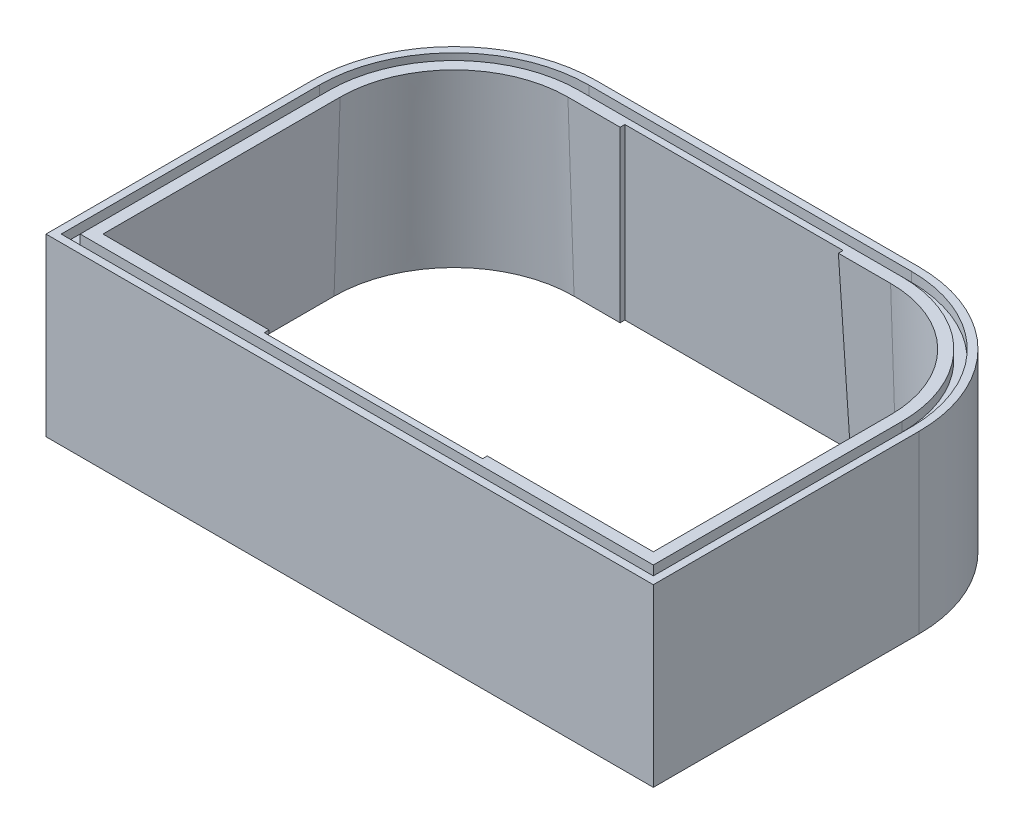
ISO-10303-21;
HEADER;
FILE_DESCRIPTION(('STEP AP214'),'2;1');
FILE_NAME('part.step','',(''),(''),'','','');
FILE_SCHEMA(('AUTOMOTIVE_DESIGN { 1 0 10303 214 1 1 1 1 }'));
ENDSEC;
DATA;
#1=APPLICATION_CONTEXT('core data for automotive mechanical design processes');
#2=APPLICATION_PROTOCOL_DEFINITION('international standard','automotive_design',2000,#1);
#3=PRODUCT_CONTEXT('',#1,'mechanical');
#4=PRODUCT('Part','Part','',(#3));
#5=PRODUCT_RELATED_PRODUCT_CATEGORY('part','',(#4));
#6=PRODUCT_DEFINITION_FORMATION('','',#4);
#7=PRODUCT_DEFINITION_CONTEXT('part definition',#1,'design');
#8=PRODUCT_DEFINITION('design','',#6,#7);
#9=PRODUCT_DEFINITION_SHAPE('','',#8);
#10=(LENGTH_UNIT() NAMED_UNIT(*) SI_UNIT(.MILLI.,.METRE.));
#11=(NAMED_UNIT(*) PLANE_ANGLE_UNIT() SI_UNIT($,.RADIAN.));
#12=(NAMED_UNIT(*) SI_UNIT($,.STERADIAN.) SOLID_ANGLE_UNIT());
#13=UNCERTAINTY_MEASURE_WITH_UNIT(LENGTH_MEASURE(1.E-05),#10,'distance_accuracy_value','');
#14=(GEOMETRIC_REPRESENTATION_CONTEXT(3) GLOBAL_UNCERTAINTY_ASSIGNED_CONTEXT((#13)) GLOBAL_UNIT_ASSIGNED_CONTEXT((#10,
#11,#12)) REPRESENTATION_CONTEXT('',''));
#15=CARTESIAN_POINT('',(0.,0.,0.));
#16=DIRECTION('',(0.,0.,1.));
#17=DIRECTION('',(1.,0.,0.));
#18=AXIS2_PLACEMENT_3D('',#15,#16,#17);
#19=CARTESIAN_POINT('',(0.,185.,0.));
#20=DIRECTION('',(0.,-1.,0.));
#21=DIRECTION('',(0.,0.,-1.));
#22=AXIS2_PLACEMENT_3D('',#19,#20,#21);
#23=PLANE('',#22);
#24=DIRECTION('',(-1.,0.,0.));
#25=VECTOR('',#24,1.);
#26=CARTESIAN_POINT('',(205.,185.,-400.));
#27=LINE('',#26,#25);
#28=CARTESIAN_POINT('',(205.,185.,-400.));
#29=VERTEX_POINT('',#28);
#30=CARTESIAN_POINT('',(150.,185.,-400.));
#31=VERTEX_POINT('',#30);
#32=EDGE_CURVE('E385',#29,#31,#27,.T.);
#33=ORIENTED_EDGE('',*,*,#32,.F.);
#34=DIRECTION('',(0.,0.,1.));
#35=VECTOR('',#34,1.);
#36=CARTESIAN_POINT('',(205.,185.,-400.));
#37=LINE('',#36,#35);
#38=CARTESIAN_POINT('',(205.,185.,-405.));
#39=VERTEX_POINT('',#38);
#40=EDGE_CURVE('E374',#39,#29,#37,.T.);
#41=ORIENTED_EDGE('',*,*,#40,.F.);
#42=DIRECTION('',(-1.,0.,0.));
#43=VECTOR('',#42,1.);
#44=CARTESIAN_POINT('',(205.,185.,-405.));
#45=LINE('',#44,#43);
#46=CARTESIAN_POINT('',(435.,185.,-405.));
#47=VERTEX_POINT('',#46);
#48=EDGE_CURVE('E421',#47,#39,#45,.T.);
#49=ORIENTED_EDGE('',*,*,#48,.F.);
#50=DIRECTION('',(0.,0.,-1.));
#51=VECTOR('',#50,1.);
#52=CARTESIAN_POINT('',(435.,185.,-400.));
#53=LINE('',#52,#51);
#54=CARTESIAN_POINT('',(435.,185.,-400.));
#55=VERTEX_POINT('',#54);
#56=EDGE_CURVE('E418',#55,#47,#53,.T.);
#57=ORIENTED_EDGE('',*,*,#56,.F.);
#58=DIRECTION('',(-1.,0.,0.));
#59=VECTOR('',#58,1.);
#60=CARTESIAN_POINT('',(490.,185.,-400.));
#61=LINE('',#60,#59);
#62=CARTESIAN_POINT('',(490.,185.,-400.));
#63=VERTEX_POINT('',#62);
#64=EDGE_CURVE('E415',#63,#55,#61,.T.);
#65=ORIENTED_EDGE('',*,*,#64,.F.);
#66=CARTESIAN_POINT('',(490.,185.,-280.));
#67=DIRECTION('',(0.,1.,0.));
#68=DIRECTION('',(0.,0.,1.));
#69=AXIS2_PLACEMENT_3D('',#66,#67,#68);
#70=CIRCLE('',#69,120.);
#71=CARTESIAN_POINT('',(610.,185.,-280.));
#72=VERTEX_POINT('',#71);
#73=EDGE_CURVE('E412',#72,#63,#70,.T.);
#74=ORIENTED_EDGE('',*,*,#73,.F.);
#75=DIRECTION('',(0.,0.,-1.));
#76=VECTOR('',#75,1.);
#77=CARTESIAN_POINT('',(610.,185.,-30.));
#78=LINE('',#77,#76);
#79=CARTESIAN_POINT('',(610.,185.,-30.));
#80=VERTEX_POINT('',#79);
#81=EDGE_CURVE('E409',#80,#72,#78,.T.);
#82=ORIENTED_EDGE('',*,*,#81,.F.);
#83=DIRECTION('',(1.,0.,0.));
#84=VECTOR('',#83,1.);
#85=CARTESIAN_POINT('',(435.,185.,-30.0000000000001));
#86=LINE('',#85,#84);
#87=CARTESIAN_POINT('',(435.,185.,-30.0000000000001));
#88=VERTEX_POINT('',#87);
#89=EDGE_CURVE('E406',#88,#80,#86,.T.);
#90=ORIENTED_EDGE('',*,*,#89,.F.);
#91=DIRECTION('',(0.,0.,-1.));
#92=VECTOR('',#91,1.);
#93=CARTESIAN_POINT('',(435.,185.,-30.0000000000001));
#94=LINE('',#93,#92);
#95=CARTESIAN_POINT('',(435.,185.,-25.));
#96=VERTEX_POINT('',#95);
#97=EDGE_CURVE('E403',#96,#88,#94,.T.);
#98=ORIENTED_EDGE('',*,*,#97,.F.);
#99=DIRECTION('',(1.,0.,0.));
#100=VECTOR('',#99,1.);
#101=CARTESIAN_POINT('',(435.,185.,-25.));
#102=LINE('',#101,#100);
#103=CARTESIAN_POINT('',(205.,185.,-25.));
#104=VERTEX_POINT('',#103);
#105=EDGE_CURVE('E400',#104,#96,#102,.T.);
#106=ORIENTED_EDGE('',*,*,#105,.F.);
#107=DIRECTION('',(0.,0.,1.));
#108=VECTOR('',#107,1.);
#109=CARTESIAN_POINT('',(205.,185.,-30.));
#110=LINE('',#109,#108);
#111=CARTESIAN_POINT('',(205.,185.,-30.));
#112=VERTEX_POINT('',#111);
#113=EDGE_CURVE('E397',#112,#104,#110,.T.);
#114=ORIENTED_EDGE('',*,*,#113,.F.);
#115=DIRECTION('',(1.,0.,0.));
#116=VECTOR('',#115,1.);
#117=CARTESIAN_POINT('',(30.,185.,-30.));
#118=LINE('',#117,#116);
#119=CARTESIAN_POINT('',(30.,185.,-30.));
#120=VERTEX_POINT('',#119);
#121=EDGE_CURVE('E394',#120,#112,#118,.T.);
#122=ORIENTED_EDGE('',*,*,#121,.F.);
#123=DIRECTION('',(0.,0.,1.));
#124=VECTOR('',#123,1.);
#125=CARTESIAN_POINT('',(30.,185.,-280.));
#126=LINE('',#125,#124);
#127=CARTESIAN_POINT('',(30.,185.,-280.));
#128=VERTEX_POINT('',#127);
#129=EDGE_CURVE('E391',#128,#120,#126,.T.);
#130=ORIENTED_EDGE('',*,*,#129,.F.);
#131=CARTESIAN_POINT('',(150.,185.,-280.));
#132=DIRECTION('',(0.,1.,0.));
#133=DIRECTION('',(0.,0.,1.));
#134=AXIS2_PLACEMENT_3D('',#131,#132,#133);
#135=CIRCLE('',#134,120.);
#136=EDGE_CURVE('E388',#31,#128,#135,.T.);
#137=ORIENTED_EDGE('',*,*,#136,.F.);
#138=EDGE_LOOP('',(#33,#41,#49,#57,#65,#74,#82,#90,#98,#106,#114,#122,#130,#137));
#139=FACE_BOUND('',#138,.T.);
#140=CARTESIAN_POINT('',(490.,185.,-280.));
#141=DIRECTION('',(0.,1.,0.));
#142=DIRECTION('',(1.,0.,0.));
#143=AXIS2_PLACEMENT_3D('',#140,#141,#142);
#144=CIRCLE('',#143,132.);
#145=CARTESIAN_POINT('',(622.,185.,-280.));
#146=VERTEX_POINT('',#145);
#147=CARTESIAN_POINT('',(490.,185.,-412.));
#148=VERTEX_POINT('',#147);
#149=EDGE_CURVE('E320',#146,#148,#144,.T.);
#150=ORIENTED_EDGE('',*,*,#149,.T.);
#151=DIRECTION('',(-1.,0.,0.));
#152=VECTOR('',#151,1.);
#153=CARTESIAN_POINT('',(490.,185.,-412.));
#154=LINE('',#153,#152);
#155=CARTESIAN_POINT('',(150.,185.,-412.));
#156=VERTEX_POINT('',#155);
#157=EDGE_CURVE('E285',#148,#156,#154,.T.);
#158=ORIENTED_EDGE('',*,*,#157,.T.);
#159=CARTESIAN_POINT('',(150.,185.,-280.));
#160=DIRECTION('',(0.,1.,0.));
#161=DIRECTION('',(1.,0.,0.));
#162=AXIS2_PLACEMENT_3D('',#159,#160,#161);
#163=CIRCLE('',#162,132.);
#164=CARTESIAN_POINT('',(18.,185.,-280.));
#165=VERTEX_POINT('',#164);
#166=EDGE_CURVE('E94',#156,#165,#163,.T.);
#167=ORIENTED_EDGE('',*,*,#166,.T.);
#168=DIRECTION('',(0.,0.,1.));
#169=VECTOR('',#168,1.);
#170=CARTESIAN_POINT('',(18.,185.,-280.));
#171=LINE('',#170,#169);
#172=CARTESIAN_POINT('',(18.,185.,-18.));
#173=VERTEX_POINT('',#172);
#174=EDGE_CURVE('E324',#165,#173,#171,.T.);
#175=ORIENTED_EDGE('',*,*,#174,.T.);
#176=DIRECTION('',(1.,0.,0.));
#177=VECTOR('',#176,1.);
#178=CARTESIAN_POINT('',(8.,185.,-18.));
#179=LINE('',#178,#177);
#180=CARTESIAN_POINT('',(622.,185.,-18.));
#181=VERTEX_POINT('',#180);
#182=EDGE_CURVE('E309',#173,#181,#179,.T.);
#183=ORIENTED_EDGE('',*,*,#182,.T.);
#184=DIRECTION('',(0.,0.,-1.));
#185=VECTOR('',#184,1.);
#186=CARTESIAN_POINT('',(622.,185.,-8.));
#187=LINE('',#186,#185);
#188=EDGE_CURVE('E306',#181,#146,#187,.T.);
#189=ORIENTED_EDGE('',*,*,#188,.T.);
#190=EDGE_LOOP('',(#150,#158,#167,#175,#183,#189));
#191=FACE_BOUND('',#190,.T.);
#192=ADVANCED_FACE('F71',(#139,#191),#23,.F.);
#193=CARTESIAN_POINT('',(0.,185.,0.));
#194=DIRECTION('',(1.,0.,0.));
#195=DIRECTION('',(0.,0.,-1.));
#196=AXIS2_PLACEMENT_3D('',#193,#194,#195);
#197=PLANE('',#196);
#198=DIRECTION('',(0.,0.,1.));
#199=VECTOR('',#198,1.);
#200=CARTESIAN_POINT('',(0.,185.,0.));
#201=LINE('',#200,#199);
#202=CARTESIAN_POINT('',(0.,185.,-280.));
#203=VERTEX_POINT('',#202);
#204=CARTESIAN_POINT('',(0.,185.,0.));
#205=VERTEX_POINT('',#204);
#206=EDGE_CURVE('E496',#203,#205,#201,.T.);
#207=ORIENTED_EDGE('',*,*,#206,.F.);
#208=DIRECTION('',(0.,-1.,0.));
#209=VECTOR('',#208,1.);
#210=CARTESIAN_POINT('',(0.,185.,-280.));
#211=LINE('',#210,#209);
#212=CARTESIAN_POINT('',(0.,0.,-280.));
#213=VERTEX_POINT('',#212);
#214=EDGE_CURVE('E521',#203,#213,#211,.T.);
#215=ORIENTED_EDGE('',*,*,#214,.T.);
#216=DIRECTION('',(0.,0.,1.));
#217=VECTOR('',#216,1.);
#218=CARTESIAN_POINT('',(0.,0.,0.));
#219=LINE('',#218,#217);
#220=CARTESIAN_POINT('',(0.,0.,0.));
#221=VERTEX_POINT('',#220);
#222=EDGE_CURVE('E427',#213,#221,#219,.T.);
#223=ORIENTED_EDGE('',*,*,#222,.T.);
#224=DIRECTION('',(0.,-1.,0.));
#225=VECTOR('',#224,1.);
#226=CARTESIAN_POINT('',(0.,185.,0.));
#227=LINE('',#226,#225);
#228=EDGE_CURVE('E518',#205,#221,#227,.T.);
#229=ORIENTED_EDGE('',*,*,#228,.F.);
#230=EDGE_LOOP('',(#207,#215,#223,#229));
#231=FACE_BOUND('',#230,.T.);
#232=ADVANCED_FACE('F545',(#231),#197,.F.);
#233=CARTESIAN_POINT('',(0.,185.,0.));
#234=DIRECTION('',(0.,0.,-1.));
#235=DIRECTION('',(-1.,0.,0.));
#236=AXIS2_PLACEMENT_3D('',#233,#234,#235);
#237=PLANE('',#236);
#238=DIRECTION('',(1.,0.,0.));
#239=VECTOR('',#238,1.);
#240=CARTESIAN_POINT('',(0.,0.,0.));
#241=LINE('',#240,#239);
#242=CARTESIAN_POINT('',(640.,0.,0.));
#243=VERTEX_POINT('',#242);
#244=EDGE_CURVE('E509',#221,#243,#241,.T.);
#245=ORIENTED_EDGE('',*,*,#244,.T.);
#246=DIRECTION('',(0.,-1.,0.));
#247=VECTOR('',#246,1.);
#248=CARTESIAN_POINT('',(640.,185.,0.));
#249=LINE('',#248,#247);
#250=CARTESIAN_POINT('',(640.,185.,0.));
#251=VERTEX_POINT('',#250);
#252=EDGE_CURVE('E507',#251,#243,#249,.T.);
#253=ORIENTED_EDGE('',*,*,#252,.F.);
#254=DIRECTION('',(1.,0.,0.));
#255=VECTOR('',#254,1.);
#256=CARTESIAN_POINT('',(0.,185.,0.));
#257=LINE('',#256,#255);
#258=EDGE_CURVE('E498',#205,#251,#257,.T.);
#259=ORIENTED_EDGE('',*,*,#258,.F.);
#260=ORIENTED_EDGE('',*,*,#228,.T.);
#261=EDGE_LOOP('',(#245,#253,#259,#260));
#262=FACE_BOUND('',#261,.T.);
#263=ADVANCED_FACE('F564',(#262),#237,.F.);
#264=CARTESIAN_POINT('',(640.,185.,0.));
#265=DIRECTION('',(-1.,0.,0.));
#266=DIRECTION('',(0.,0.,1.));
#267=AXIS2_PLACEMENT_3D('',#264,#265,#266);
#268=PLANE('',#267);
#269=DIRECTION('',(0.,0.,-1.));
#270=VECTOR('',#269,1.);
#271=CARTESIAN_POINT('',(640.,0.,0.));
#272=LINE('',#271,#270);
#273=CARTESIAN_POINT('',(640.,0.,-280.));
#274=VERTEX_POINT('',#273);
#275=EDGE_CURVE('E511',#243,#274,#272,.T.);
#276=ORIENTED_EDGE('',*,*,#275,.T.);
#277=DIRECTION('',(0.,-1.,0.));
#278=VECTOR('',#277,1.);
#279=CARTESIAN_POINT('',(640.,185.,-280.));
#280=LINE('',#279,#278);
#281=CARTESIAN_POINT('',(640.,185.,-280.));
#282=VERTEX_POINT('',#281);
#283=EDGE_CURVE('E12',#274,#282,#280,.F.);
#284=ORIENTED_EDGE('',*,*,#283,.T.);
#285=DIRECTION('',(0.,0.,-1.));
#286=VECTOR('',#285,1.);
#287=CARTESIAN_POINT('',(640.,185.,0.));
#288=LINE('',#287,#286);
#289=EDGE_CURVE('E501',#251,#282,#288,.T.);
#290=ORIENTED_EDGE('',*,*,#289,.F.);
#291=ORIENTED_EDGE('',*,*,#252,.T.);
#292=EDGE_LOOP('',(#276,#284,#290,#291));
#293=FACE_BOUND('',#292,.T.);
#294=ADVANCED_FACE('F560',(#293),#268,.F.);
#295=CARTESIAN_POINT('',(0.,185.,-430.));
#296=DIRECTION('',(0.,0.,1.));
#297=DIRECTION('',(1.,0.,0.));
#298=AXIS2_PLACEMENT_3D('',#295,#296,#297);
#299=PLANE('',#298);
#300=DIRECTION('',(-1.,0.,0.));
#301=VECTOR('',#300,1.);
#302=CARTESIAN_POINT('',(0.,0.,-430.));
#303=LINE('',#302,#301);
#304=CARTESIAN_POINT('',(490.,0.,-430.));
#305=VERTEX_POINT('',#304);
#306=CARTESIAN_POINT('',(150.,0.,-430.));
#307=VERTEX_POINT('',#306);
#308=EDGE_CURVE('E499',#305,#307,#303,.T.);
#309=ORIENTED_EDGE('',*,*,#308,.T.);
#310=DIRECTION('',(0.,-1.,0.));
#311=VECTOR('',#310,1.);
#312=CARTESIAN_POINT('',(150.,185.,-430.));
#313=LINE('',#312,#311);
#314=CARTESIAN_POINT('',(150.,185.,-430.));
#315=VERTEX_POINT('',#314);
#316=EDGE_CURVE('E531',#307,#315,#313,.F.);
#317=ORIENTED_EDGE('',*,*,#316,.T.);
#318=DIRECTION('',(-1.,0.,0.));
#319=VECTOR('',#318,1.);
#320=CARTESIAN_POINT('',(0.,185.,-430.));
#321=LINE('',#320,#319);
#322=CARTESIAN_POINT('',(490.,185.,-430.));
#323=VERTEX_POINT('',#322);
#324=EDGE_CURVE('E504',#323,#315,#321,.T.);
#325=ORIENTED_EDGE('',*,*,#324,.F.);
#326=DIRECTION('',(0.,-1.,0.));
#327=VECTOR('',#326,1.);
#328=CARTESIAN_POINT('',(490.,185.,-430.));
#329=LINE('',#328,#327);
#330=EDGE_CURVE('E528',#323,#305,#329,.T.);
#331=ORIENTED_EDGE('',*,*,#330,.T.);
#332=EDGE_LOOP('',(#309,#317,#325,#331));
#333=FACE_BOUND('',#332,.T.);
#334=ADVANCED_FACE('F553',(#333),#299,.F.);
#335=DIRECTION('',(-1.,0.,0.));
#336=VECTOR('',#335,1.);
#337=CARTESIAN_POINT('',(490.,185.,-422.));
#338=LINE('',#337,#336);
#339=CARTESIAN_POINT('',(490.,185.,-422.));
#340=VERTEX_POINT('',#339);
#341=CARTESIAN_POINT('',(150.,185.,-422.));
#342=VERTEX_POINT('',#341);
#343=EDGE_CURVE('E358',#340,#342,#338,.T.);
#344=ORIENTED_EDGE('',*,*,#343,.F.);
#345=CARTESIAN_POINT('',(490.,185.,-280.));
#346=DIRECTION('',(0.,1.,0.));
#347=DIRECTION('',(0.,0.,1.));
#348=AXIS2_PLACEMENT_3D('',#345,#346,#347);
#349=CIRCLE('',#348,142.);
#350=CARTESIAN_POINT('',(632.,185.,-280.));
#351=VERTEX_POINT('',#350);
#352=EDGE_CURVE('E86',#351,#340,#349,.T.);
#353=ORIENTED_EDGE('',*,*,#352,.F.);
#354=DIRECTION('',(0.,0.,-1.));
#355=VECTOR('',#354,1.);
#356=CARTESIAN_POINT('',(632.,185.,-8.));
#357=LINE('',#356,#355);
#358=CARTESIAN_POINT('',(632.,185.,-8.));
#359=VERTEX_POINT('',#358);
#360=EDGE_CURVE('E341',#359,#351,#357,.T.);
#361=ORIENTED_EDGE('',*,*,#360,.F.);
#362=DIRECTION('',(1.,0.,0.));
#363=VECTOR('',#362,1.);
#364=CARTESIAN_POINT('',(8.,185.,-8.));
#365=LINE('',#364,#363);
#366=CARTESIAN_POINT('',(8.,185.,-8.));
#367=VERTEX_POINT('',#366);
#368=EDGE_CURVE('E367',#367,#359,#365,.T.);
#369=ORIENTED_EDGE('',*,*,#368,.F.);
#370=DIRECTION('',(0.,0.,1.));
#371=VECTOR('',#370,1.);
#372=CARTESIAN_POINT('',(8.00000000000004,185.,-280.));
#373=LINE('',#372,#371);
#374=CARTESIAN_POINT('',(8.00000000000004,185.,-280.));
#375=VERTEX_POINT('',#374);
#376=EDGE_CURVE('E364',#375,#367,#373,.T.);
#377=ORIENTED_EDGE('',*,*,#376,.F.);
#378=CARTESIAN_POINT('',(150.,185.,-280.));
#379=DIRECTION('',(0.,1.,0.));
#380=DIRECTION('',(0.,0.,1.));
#381=AXIS2_PLACEMENT_3D('',#378,#379,#380);
#382=CIRCLE('',#381,142.);
#383=EDGE_CURVE('E361',#342,#375,#382,.T.);
#384=ORIENTED_EDGE('',*,*,#383,.F.);
#385=EDGE_LOOP('',(#344,#353,#361,#369,#377,#384));
#386=FACE_BOUND('',#385,.T.);
#387=ORIENTED_EDGE('',*,*,#324,.T.);
#388=CARTESIAN_POINT('',(150.,185.,-280.));
#389=DIRECTION('',(0.,-1.,0.));
#390=DIRECTION('',(0.,0.,-1.));
#391=AXIS2_PLACEMENT_3D('',#388,#389,#390);
#392=CIRCLE('',#391,150.);
#393=EDGE_CURVE('E79',#315,#203,#392,.F.);
#394=ORIENTED_EDGE('',*,*,#393,.T.);
#395=ORIENTED_EDGE('',*,*,#206,.T.);
#396=ORIENTED_EDGE('',*,*,#258,.T.);
#397=ORIENTED_EDGE('',*,*,#289,.T.);
#398=CARTESIAN_POINT('',(490.,185.,-280.));
#399=DIRECTION('',(0.,-1.,0.));
#400=DIRECTION('',(0.,0.,-1.));
#401=AXIS2_PLACEMENT_3D('',#398,#399,#400);
#402=CIRCLE('',#401,150.);
#403=EDGE_CURVE('E533',#282,#323,#402,.F.);
#404=ORIENTED_EDGE('',*,*,#403,.T.);
#405=EDGE_LOOP('',(#387,#394,#395,#396,#397,#404));
#406=FACE_BOUND('',#405,.T.);
#407=ADVANCED_FACE('F537',(#386,#406),#23,.F.);
#408=CARTESIAN_POINT('',(0.,0.,0.));
#409=DIRECTION('',(0.,-1.,0.));
#410=DIRECTION('',(0.,0.,-1.));
#411=AXIS2_PLACEMENT_3D('',#408,#409,#410);
#412=PLANE('',#411);
#413=DIRECTION('',(0.,0.,1.));
#414=VECTOR('',#413,1.);
#415=CARTESIAN_POINT('',(198.539657644026,0.,-280.));
#416=LINE('',#415,#414);
#417=CARTESIAN_POINT('',(198.539657644026,0.,-411.460342355973));
#418=VERTEX_POINT('',#417);
#419=CARTESIAN_POINT('',(198.539657644026,0.,-406.460342355973));
#420=VERTEX_POINT('',#419);
#421=EDGE_CURVE('E424',#418,#420,#416,.T.);
#422=ORIENTED_EDGE('',*,*,#421,.T.);
#423=DIRECTION('',(-1.,0.,0.));
#424=VECTOR('',#423,1.);
#425=CARTESIAN_POINT('',(490.,0.,-406.460342355972));
#426=LINE('',#425,#424);
#427=CARTESIAN_POINT('',(150.,0.,-406.460342355973));
#428=VERTEX_POINT('',#427);
#429=EDGE_CURVE('E454',#420,#428,#426,.T.);
#430=ORIENTED_EDGE('',*,*,#429,.T.);
#431=CARTESIAN_POINT('',(150.,0.,-280.));
#432=DIRECTION('',(0.,1.,0.));
#433=DIRECTION('',(0.,0.,1.));
#434=AXIS2_PLACEMENT_3D('',#431,#432,#433);
#435=CIRCLE('',#434,126.460342355973);
#436=CARTESIAN_POINT('',(23.5396576440267,0.,-280.));
#437=VERTEX_POINT('',#436);
#438=EDGE_CURVE('E487',#428,#437,#435,.T.);
#439=ORIENTED_EDGE('',*,*,#438,.T.);
#440=DIRECTION('',(0.,0.,1.));
#441=VECTOR('',#440,1.);
#442=CARTESIAN_POINT('',(23.5396576440267,0.,-280.));
#443=LINE('',#442,#441);
#444=CARTESIAN_POINT('',(23.5396576440267,0.,-23.5396576440267));
#445=VERTEX_POINT('',#444);
#446=EDGE_CURVE('E484',#437,#445,#443,.T.);
#447=ORIENTED_EDGE('',*,*,#446,.T.);
#448=DIRECTION('',(1.,0.,0.));
#449=VECTOR('',#448,1.);
#450=CARTESIAN_POINT('',(490.,0.,-23.5396576440268));
#451=LINE('',#450,#449);
#452=CARTESIAN_POINT('',(198.539657644027,0.,-23.5396576440267));
#453=VERTEX_POINT('',#452);
#454=EDGE_CURVE('E481',#445,#453,#451,.T.);
#455=ORIENTED_EDGE('',*,*,#454,.T.);
#456=DIRECTION('',(0.,0.,1.));
#457=VECTOR('',#456,1.);
#458=CARTESIAN_POINT('',(198.539657644027,0.,-280.));
#459=LINE('',#458,#457);
#460=CARTESIAN_POINT('',(198.539657644027,0.,-18.5396576440266));
#461=VERTEX_POINT('',#460);
#462=EDGE_CURVE('E478',#453,#461,#459,.T.);
#463=ORIENTED_EDGE('',*,*,#462,.T.);
#464=DIRECTION('',(1.,0.,0.));
#465=VECTOR('',#464,1.);
#466=CARTESIAN_POINT('',(490.,0.,-18.5396576440268));
#467=LINE('',#466,#465);
#468=CARTESIAN_POINT('',(441.460342355973,0.,-18.5396576440267));
#469=VERTEX_POINT('',#468);
#470=EDGE_CURVE('E475',#461,#469,#467,.T.);
#471=ORIENTED_EDGE('',*,*,#470,.T.);
#472=DIRECTION('',(0.,0.,-1.));
#473=VECTOR('',#472,1.);
#474=CARTESIAN_POINT('',(441.460342355973,0.,-280.));
#475=LINE('',#474,#473);
#476=CARTESIAN_POINT('',(441.460342355973,0.,-23.5396576440267));
#477=VERTEX_POINT('',#476);
#478=EDGE_CURVE('E472',#469,#477,#475,.T.);
#479=ORIENTED_EDGE('',*,*,#478,.T.);
#480=DIRECTION('',(1.,0.,0.));
#481=VECTOR('',#480,1.);
#482=CARTESIAN_POINT('',(490.,0.,-23.5396576440268));
#483=LINE('',#482,#481);
#484=CARTESIAN_POINT('',(616.460342355973,0.,-23.5396576440267));
#485=VERTEX_POINT('',#484);
#486=EDGE_CURVE('E469',#477,#485,#483,.T.);
#487=ORIENTED_EDGE('',*,*,#486,.T.);
#488=DIRECTION('',(0.,0.,-1.));
#489=VECTOR('',#488,1.);
#490=CARTESIAN_POINT('',(616.460342355973,0.,-280.));
#491=LINE('',#490,#489);
#492=CARTESIAN_POINT('',(616.460342355973,0.,-280.));
#493=VERTEX_POINT('',#492);
#494=EDGE_CURVE('E466',#485,#493,#491,.T.);
#495=ORIENTED_EDGE('',*,*,#494,.T.);
#496=CARTESIAN_POINT('',(490.,0.,-280.));
#497=DIRECTION('',(0.,1.,0.));
#498=DIRECTION('',(0.,0.,1.));
#499=AXIS2_PLACEMENT_3D('',#496,#497,#498);
#500=CIRCLE('',#499,126.460342355973);
#501=CARTESIAN_POINT('',(490.,0.,-406.460342355973));
#502=VERTEX_POINT('',#501);
#503=EDGE_CURVE('E463',#493,#502,#500,.T.);
#504=ORIENTED_EDGE('',*,*,#503,.T.);
#505=DIRECTION('',(-1.,0.,0.));
#506=VECTOR('',#505,1.);
#507=CARTESIAN_POINT('',(490.,0.,-406.460342355973));
#508=LINE('',#507,#506);
#509=CARTESIAN_POINT('',(441.460342355973,0.,-406.460342355973));
#510=VERTEX_POINT('',#509);
#511=EDGE_CURVE('E460',#502,#510,#508,.T.);
#512=ORIENTED_EDGE('',*,*,#511,.T.);
#513=DIRECTION('',(0.,0.,-1.));
#514=VECTOR('',#513,1.);
#515=CARTESIAN_POINT('',(441.460342355973,0.,-280.));
#516=LINE('',#515,#514);
#517=CARTESIAN_POINT('',(441.460342355973,0.,-411.460342355973));
#518=VERTEX_POINT('',#517);
#519=EDGE_CURVE('E457',#510,#518,#516,.T.);
#520=ORIENTED_EDGE('',*,*,#519,.T.);
#521=DIRECTION('',(-1.,0.,0.));
#522=VECTOR('',#521,1.);
#523=CARTESIAN_POINT('',(490.,0.,-411.460342355973));
#524=LINE('',#523,#522);
#525=EDGE_CURVE('E433',#518,#418,#524,.T.);
#526=ORIENTED_EDGE('',*,*,#525,.T.);
#527=EDGE_LOOP('',(#422,#430,#439,#447,#455,#463,#471,#479,#487,#495,#504,#512,#520,#526));
#528=FACE_BOUND('',#527,.T.);
#529=ORIENTED_EDGE('',*,*,#222,.F.);
#530=CARTESIAN_POINT('',(150.,0.,-280.));
#531=DIRECTION('',(0.,-1.,0.));
#532=DIRECTION('',(0.,0.,-1.));
#533=AXIS2_PLACEMENT_3D('',#530,#531,#532);
#534=CIRCLE('',#533,150.);
#535=EDGE_CURVE('E526',#213,#307,#534,.T.);
#536=ORIENTED_EDGE('',*,*,#535,.T.);
#537=ORIENTED_EDGE('',*,*,#308,.F.);
#538=CARTESIAN_POINT('',(490.,0.,-280.));
#539=DIRECTION('',(0.,-1.,0.));
#540=DIRECTION('',(0.,0.,-1.));
#541=AXIS2_PLACEMENT_3D('',#538,#539,#540);
#542=CIRCLE('',#541,150.);
#543=EDGE_CURVE('E524',#305,#274,#542,.T.);
#544=ORIENTED_EDGE('',*,*,#543,.T.);
#545=ORIENTED_EDGE('',*,*,#275,.F.);
#546=ORIENTED_EDGE('',*,*,#244,.F.);
#547=EDGE_LOOP('',(#529,#536,#537,#544,#545,#546));
#548=FACE_BOUND('',#547,.T.);
#549=ADVANCED_FACE('F550',(#528,#548),#412,.T.);
#550=CARTESIAN_POINT('',(150.,185.,-280.));
#551=DIRECTION('',(0.,-1.,0.));
#552=DIRECTION('',(0.,0.,-1.));
#553=AXIS2_PLACEMENT_3D('',#550,#551,#552);
#554=CYLINDRICAL_SURFACE('',#553,150.);
#555=ORIENTED_EDGE('',*,*,#393,.F.);
#556=ORIENTED_EDGE('',*,*,#316,.F.);
#557=ORIENTED_EDGE('',*,*,#535,.F.);
#558=ORIENTED_EDGE('',*,*,#214,.F.);
#559=EDGE_LOOP('',(#555,#556,#557,#558));
#560=FACE_BOUND('',#559,.T.);
#561=ADVANCED_FACE('F547',(#560),#554,.T.);
#562=CARTESIAN_POINT('',(490.,185.,-280.));
#563=DIRECTION('',(0.,-1.,0.));
#564=DIRECTION('',(0.,0.,-1.));
#565=AXIS2_PLACEMENT_3D('',#562,#563,#564);
#566=CYLINDRICAL_SURFACE('',#565,150.);
#567=ORIENTED_EDGE('',*,*,#403,.F.);
#568=ORIENTED_EDGE('',*,*,#283,.F.);
#569=ORIENTED_EDGE('',*,*,#543,.F.);
#570=ORIENTED_EDGE('',*,*,#330,.F.);
#571=EDGE_LOOP('',(#567,#568,#569,#570));
#572=FACE_BOUND('',#571,.T.);
#573=ADVANCED_FACE('F73',(#572),#566,.T.);
#574=CARTESIAN_POINT('',(205.,185.,-400.));
#575=DIRECTION('',(-0.999390827019096,0.034899496702501,0.));
#576=DIRECTION('',(-0.034899496702501,-0.999390827019096,0.));
#577=AXIS2_PLACEMENT_3D('',#574,#575,#576);
#578=PLANE('',#577);
#579=ORIENTED_EDGE('',*,*,#40,.T.);
#580=DIRECTION('',(0.0348782627423747,0.998782765958718,0.0348782627423748));
#581=VECTOR('',#580,1.);
#582=CARTESIAN_POINT('',(205.,185.,-400.));
#583=LINE('',#582,#581);
#584=EDGE_CURVE('E429',#420,#29,#583,.T.);
#585=ORIENTED_EDGE('',*,*,#584,.F.);
#586=ORIENTED_EDGE('',*,*,#421,.F.);
#587=DIRECTION('',(0.0348782627423747,0.998782765958718,0.0348782627423747));
#588=VECTOR('',#587,1.);
#589=CARTESIAN_POINT('',(205.,185.,-405.));
#590=LINE('',#589,#588);
#591=EDGE_CURVE('E425',#418,#39,#590,.T.);
#592=ORIENTED_EDGE('',*,*,#591,.T.);
#593=EDGE_LOOP('',(#579,#585,#586,#592));
#594=FACE_BOUND('',#593,.T.);
#595=ADVANCED_FACE('F625',(#594),#578,.F.);
#596=CARTESIAN_POINT('',(205.,185.,-405.));
#597=DIRECTION('',(0.,0.034899496702501,-0.999390827019096));
#598=DIRECTION('',(0.,0.999390827019096,0.034899496702501));
#599=AXIS2_PLACEMENT_3D('',#596,#597,#598);
#600=PLANE('',#599);
#601=ORIENTED_EDGE('',*,*,#48,.T.);
#602=ORIENTED_EDGE('',*,*,#591,.F.);
#603=ORIENTED_EDGE('',*,*,#525,.F.);
#604=DIRECTION('',(-0.0348782627423747,0.998782765958718,0.0348782627423747));
#605=VECTOR('',#604,1.);
#606=CARTESIAN_POINT('',(434.99391753394,185.174179038668,-404.99391753394));
#607=LINE('',#606,#605);
#608=EDGE_CURVE('E428',#518,#47,#607,.T.);
#609=ORIENTED_EDGE('',*,*,#608,.T.);
#610=EDGE_LOOP('',(#601,#602,#603,#609));
#611=FACE_BOUND('',#610,.T.);
#612=ADVANCED_FACE('F628',(#611),#600,.F.);
#613=CARTESIAN_POINT('',(435.,185.,-400.));
#614=DIRECTION('',(0.999390827019096,0.034899496702501,0.));
#615=DIRECTION('',(-0.034899496702501,0.999390827019096,0.));
#616=AXIS2_PLACEMENT_3D('',#613,#614,#615);
#617=PLANE('',#616);
#618=ORIENTED_EDGE('',*,*,#56,.T.);
#619=ORIENTED_EDGE('',*,*,#608,.F.);
#620=ORIENTED_EDGE('',*,*,#519,.F.);
#621=DIRECTION('',(-0.0348782627423747,0.998782765958718,0.0348782627423747));
#622=VECTOR('',#621,1.);
#623=CARTESIAN_POINT('',(435.,185.,-400.));
#624=LINE('',#623,#622);
#625=EDGE_CURVE('E448',#510,#55,#624,.T.);
#626=ORIENTED_EDGE('',*,*,#625,.T.);
#627=EDGE_LOOP('',(#618,#619,#620,#626));
#628=FACE_BOUND('',#627,.T.);
#629=ADVANCED_FACE('F672',(#628),#617,.F.);
#630=CARTESIAN_POINT('',(490.,185.,-400.));
#631=DIRECTION('',(0.,0.034899496702501,-0.999390827019096));
#632=DIRECTION('',(0.,0.999390827019096,0.034899496702501));
#633=AXIS2_PLACEMENT_3D('',#630,#631,#632);
#634=PLANE('',#633);
#635=ORIENTED_EDGE('',*,*,#64,.T.);
#636=ORIENTED_EDGE('',*,*,#625,.F.);
#637=ORIENTED_EDGE('',*,*,#511,.F.);
#638=DIRECTION('',(0.,-0.999390827019096,-0.034899496702501));
#639=VECTOR('',#638,1.);
#640=CARTESIAN_POINT('',(490.,185.,-400.));
#641=LINE('',#640,#639);
#642=EDGE_CURVE('E450',#502,#63,#641,.F.);
#643=ORIENTED_EDGE('',*,*,#642,.T.);
#644=EDGE_LOOP('',(#635,#636,#637,#643));
#645=FACE_BOUND('',#644,.T.);
#646=ADVANCED_FACE('F668',(#645),#634,.F.);
#647=CARTESIAN_POINT('',(490.,185.,-280.));
#648=DIRECTION('',(0.,-1.,0.));
#649=DIRECTION('',(0.,0.,1.));
#650=AXIS2_PLACEMENT_3D('',#647,#648,#649);
#651=CONICAL_SURFACE('',#650,120.,0.0349065850398867);
#652=ORIENTED_EDGE('',*,*,#73,.T.);
#653=ORIENTED_EDGE('',*,*,#642,.F.);
#654=ORIENTED_EDGE('',*,*,#503,.F.);
#655=DIRECTION('',(0.034899496702501,-0.999390827019096,0.));
#656=VECTOR('',#655,1.);
#657=CARTESIAN_POINT('',(610.,185.,-280.));
#658=LINE('',#657,#656);
#659=EDGE_CURVE('E447',#493,#72,#658,.F.);
#660=ORIENTED_EDGE('',*,*,#659,.T.);
#661=EDGE_LOOP('',(#652,#653,#654,#660));
#662=FACE_BOUND('',#661,.T.);
#663=ADVANCED_FACE('F664',(#662),#651,.F.);
#664=CARTESIAN_POINT('',(610.,185.,-30.));
#665=DIRECTION('',(0.999390827019096,0.034899496702501,0.));
#666=DIRECTION('',(-0.034899496702501,0.999390827019096,0.));
#667=AXIS2_PLACEMENT_3D('',#664,#665,#666);
#668=PLANE('',#667);
#669=ORIENTED_EDGE('',*,*,#81,.T.);
#670=ORIENTED_EDGE('',*,*,#659,.F.);
#671=ORIENTED_EDGE('',*,*,#494,.F.);
#672=DIRECTION('',(-0.0348782627423747,0.998782765958718,-0.0348782627423747));
#673=VECTOR('',#672,1.);
#674=CARTESIAN_POINT('',(609.787113687913,191.096266353391,-30.2128863120871));
#675=LINE('',#674,#673);
#676=EDGE_CURVE('E445',#485,#80,#675,.T.);
#677=ORIENTED_EDGE('',*,*,#676,.T.);
#678=EDGE_LOOP('',(#669,#670,#671,#677));
#679=FACE_BOUND('',#678,.T.);
#680=ADVANCED_FACE('F660',(#679),#668,.F.);
#681=CARTESIAN_POINT('',(435.,185.,-30.0000000000001));
#682=DIRECTION('',(0.,0.034899496702501,0.999390827019096));
#683=DIRECTION('',(0.,-0.999390827019096,0.034899496702501));
#684=AXIS2_PLACEMENT_3D('',#681,#682,#683);
#685=PLANE('',#684);
#686=ORIENTED_EDGE('',*,*,#89,.T.);
#687=ORIENTED_EDGE('',*,*,#676,.F.);
#688=ORIENTED_EDGE('',*,*,#486,.F.);
#689=DIRECTION('',(-0.0348782627423747,0.998782765958718,-0.0348782627423747));
#690=VECTOR('',#689,1.);
#691=CARTESIAN_POINT('',(435.,185.,-30.0000000000001));
#692=LINE('',#691,#690);
#693=EDGE_CURVE('E443',#477,#88,#692,.T.);
#694=ORIENTED_EDGE('',*,*,#693,.T.);
#695=EDGE_LOOP('',(#686,#687,#688,#694));
#696=FACE_BOUND('',#695,.T.);
#697=ADVANCED_FACE('F656',(#696),#685,.F.);
#698=CARTESIAN_POINT('',(435.,185.,-30.0000000000001));
#699=DIRECTION('',(0.999390827019096,0.034899496702501,0.));
#700=DIRECTION('',(-0.034899496702501,0.999390827019096,0.));
#701=AXIS2_PLACEMENT_3D('',#698,#699,#700);
#702=PLANE('',#701);
#703=ORIENTED_EDGE('',*,*,#97,.T.);
#704=ORIENTED_EDGE('',*,*,#693,.F.);
#705=ORIENTED_EDGE('',*,*,#478,.F.);
#706=DIRECTION('',(-0.0348782627423747,0.998782765958718,-0.0348782627423747));
#707=VECTOR('',#706,1.);
#708=CARTESIAN_POINT('',(435.,185.,-25.));
#709=LINE('',#708,#707);
#710=EDGE_CURVE('E441',#469,#96,#709,.T.);
#711=ORIENTED_EDGE('',*,*,#710,.T.);
#712=EDGE_LOOP('',(#703,#704,#705,#711));
#713=FACE_BOUND('',#712,.T.);
#714=ADVANCED_FACE('F652',(#713),#702,.F.);
#715=CARTESIAN_POINT('',(435.,185.,-25.));
#716=DIRECTION('',(0.,0.034899496702501,0.999390827019096));
#717=DIRECTION('',(0.,-0.999390827019096,0.034899496702501));
#718=AXIS2_PLACEMENT_3D('',#715,#716,#717);
#719=PLANE('',#718);
#720=ORIENTED_EDGE('',*,*,#105,.T.);
#721=ORIENTED_EDGE('',*,*,#710,.F.);
#722=ORIENTED_EDGE('',*,*,#470,.F.);
#723=DIRECTION('',(0.0348782627423747,0.998782765958718,-0.0348782627423747));
#724=VECTOR('',#723,1.);
#725=CARTESIAN_POINT('',(205.00608246606,185.174179038668,-25.0060824660596));
#726=LINE('',#725,#724);
#727=EDGE_CURVE('E439',#461,#104,#726,.T.);
#728=ORIENTED_EDGE('',*,*,#727,.T.);
#729=EDGE_LOOP('',(#720,#721,#722,#728));
#730=FACE_BOUND('',#729,.T.);
#731=ADVANCED_FACE('F648',(#730),#719,.F.);
#732=CARTESIAN_POINT('',(205.,185.,-30.));
#733=DIRECTION('',(-0.999390827019096,0.034899496702501,0.));
#734=DIRECTION('',(-0.034899496702501,-0.999390827019096,0.));
#735=AXIS2_PLACEMENT_3D('',#732,#733,#734);
#736=PLANE('',#735);
#737=ORIENTED_EDGE('',*,*,#113,.T.);
#738=ORIENTED_EDGE('',*,*,#727,.F.);
#739=ORIENTED_EDGE('',*,*,#462,.F.);
#740=DIRECTION('',(0.0348782627423747,0.998782765958718,-0.0348782627423747));
#741=VECTOR('',#740,1.);
#742=CARTESIAN_POINT('',(205.,185.,-30.));
#743=LINE('',#742,#741);
#744=EDGE_CURVE('E436',#453,#112,#743,.T.);
#745=ORIENTED_EDGE('',*,*,#744,.T.);
#746=EDGE_LOOP('',(#737,#738,#739,#745));
#747=FACE_BOUND('',#746,.T.);
#748=ADVANCED_FACE('F644',(#747),#736,.F.);
#749=CARTESIAN_POINT('',(30.,185.,-30.));
#750=DIRECTION('',(0.,0.034899496702501,0.999390827019096));
#751=DIRECTION('',(0.,-0.999390827019096,0.034899496702501));
#752=AXIS2_PLACEMENT_3D('',#749,#750,#751);
#753=PLANE('',#752);
#754=ORIENTED_EDGE('',*,*,#121,.T.);
#755=ORIENTED_EDGE('',*,*,#744,.F.);
#756=ORIENTED_EDGE('',*,*,#454,.F.);
#757=DIRECTION('',(0.0348782627423747,0.998782765958718,-0.0348782627423747));
#758=VECTOR('',#757,1.);
#759=CARTESIAN_POINT('',(30.3041233029815,193.708951933416,-30.3041233029816));
#760=LINE('',#759,#758);
#761=EDGE_CURVE('E434',#445,#120,#760,.T.);
#762=ORIENTED_EDGE('',*,*,#761,.T.);
#763=EDGE_LOOP('',(#754,#755,#756,#762));
#764=FACE_BOUND('',#763,.T.);
#765=ADVANCED_FACE('F640',(#764),#753,.F.);
#766=CARTESIAN_POINT('',(30.,185.,-280.));
#767=DIRECTION('',(-0.999390827019096,0.034899496702501,0.));
#768=DIRECTION('',(-0.034899496702501,-0.999390827019096,0.));
#769=AXIS2_PLACEMENT_3D('',#766,#767,#768);
#770=PLANE('',#769);
#771=ORIENTED_EDGE('',*,*,#129,.T.);
#772=ORIENTED_EDGE('',*,*,#761,.F.);
#773=ORIENTED_EDGE('',*,*,#446,.F.);
#774=DIRECTION('',(-0.034899496702501,-0.999390827019096,0.));
#775=VECTOR('',#774,1.);
#776=CARTESIAN_POINT('',(30.,185.,-280.));
#777=LINE('',#776,#775);
#778=EDGE_CURVE('E437',#437,#128,#777,.F.);
#779=ORIENTED_EDGE('',*,*,#778,.T.);
#780=EDGE_LOOP('',(#771,#772,#773,#779));
#781=FACE_BOUND('',#780,.T.);
#782=ADVANCED_FACE('F636',(#781),#770,.F.);
#783=CARTESIAN_POINT('',(150.,185.,-280.));
#784=DIRECTION('',(0.,-1.,0.));
#785=DIRECTION('',(0.,0.,1.));
#786=AXIS2_PLACEMENT_3D('',#783,#784,#785);
#787=CONICAL_SURFACE('',#786,120.,0.0349065850398867);
#788=ORIENTED_EDGE('',*,*,#136,.T.);
#789=ORIENTED_EDGE('',*,*,#778,.F.);
#790=ORIENTED_EDGE('',*,*,#438,.F.);
#791=DIRECTION('',(0.,-0.999390827019096,-0.034899496702501));
#792=VECTOR('',#791,1.);
#793=CARTESIAN_POINT('',(150.,185.,-400.));
#794=LINE('',#793,#792);
#795=EDGE_CURVE('E432',#428,#31,#794,.F.);
#796=ORIENTED_EDGE('',*,*,#795,.T.);
#797=EDGE_LOOP('',(#788,#789,#790,#796));
#798=FACE_BOUND('',#797,.T.);
#799=ADVANCED_FACE('F632',(#798),#787,.F.);
#800=CARTESIAN_POINT('',(205.,185.,-400.));
#801=DIRECTION('',(0.,0.034899496702501,-0.999390827019096));
#802=DIRECTION('',(0.,0.999390827019096,0.034899496702501));
#803=AXIS2_PLACEMENT_3D('',#800,#801,#802);
#804=PLANE('',#803);
#805=ORIENTED_EDGE('',*,*,#32,.T.);
#806=ORIENTED_EDGE('',*,*,#795,.F.);
#807=ORIENTED_EDGE('',*,*,#429,.F.);
#808=ORIENTED_EDGE('',*,*,#584,.T.);
#809=EDGE_LOOP('',(#805,#806,#807,#808));
#810=FACE_BOUND('',#809,.T.);
#811=ADVANCED_FACE('F624',(#810),#804,.F.);
#812=CARTESIAN_POINT('',(490.,175.,-280.));
#813=DIRECTION('',(0.,1.,0.));
#814=DIRECTION('',(0.,0.,1.));
#815=AXIS2_PLACEMENT_3D('',#812,#813,#814);
#816=CYLINDRICAL_SURFACE('',#815,142.);
#817=ORIENTED_EDGE('',*,*,#352,.T.);
#818=DIRECTION('',(0.,1.,0.));
#819=VECTOR('',#818,1.);
#820=CARTESIAN_POINT('',(490.,175.,-422.));
#821=LINE('',#820,#819);
#822=CARTESIAN_POINT('',(490.,175.,-422.));
#823=VERTEX_POINT('',#822);
#824=EDGE_CURVE('E356',#823,#340,#821,.T.);
#825=ORIENTED_EDGE('',*,*,#824,.F.);
#826=CARTESIAN_POINT('',(490.,175.,-280.));
#827=DIRECTION('',(0.,1.,0.));
#828=DIRECTION('',(0.,0.,1.));
#829=AXIS2_PLACEMENT_3D('',#826,#827,#828);
#830=CIRCLE('',#829,142.);
#831=CARTESIAN_POINT('',(632.,175.,-280.));
#832=VERTEX_POINT('',#831);
#833=EDGE_CURVE('E337',#832,#823,#830,.T.);
#834=ORIENTED_EDGE('',*,*,#833,.F.);
#835=DIRECTION('',(0.,1.,0.));
#836=VECTOR('',#835,1.);
#837=CARTESIAN_POINT('',(632.,175.,-280.));
#838=LINE('',#837,#836);
#839=EDGE_CURVE('E372',#832,#351,#838,.T.);
#840=ORIENTED_EDGE('',*,*,#839,.T.);
#841=EDGE_LOOP('',(#817,#825,#834,#840));
#842=FACE_BOUND('',#841,.T.);
#843=ADVANCED_FACE('F599',(#842),#816,.F.);
#844=CARTESIAN_POINT('',(632.,175.,-8.));
#845=DIRECTION('',(1.,0.,0.));
#846=DIRECTION('',(0.,0.,-1.));
#847=AXIS2_PLACEMENT_3D('',#844,#845,#846);
#848=PLANE('',#847);
#849=ORIENTED_EDGE('',*,*,#360,.T.);
#850=ORIENTED_EDGE('',*,*,#839,.F.);
#851=DIRECTION('',(0.,0.,-1.));
#852=VECTOR('',#851,1.);
#853=CARTESIAN_POINT('',(632.,175.,-8.));
#854=LINE('',#853,#852);
#855=CARTESIAN_POINT('',(632.,175.,-8.));
#856=VERTEX_POINT('',#855);
#857=EDGE_CURVE('E353',#856,#832,#854,.T.);
#858=ORIENTED_EDGE('',*,*,#857,.F.);
#859=DIRECTION('',(0.,1.,0.));
#860=VECTOR('',#859,1.);
#861=CARTESIAN_POINT('',(632.,175.,-8.));
#862=LINE('',#861,#860);
#863=EDGE_CURVE('E375',#856,#359,#862,.T.);
#864=ORIENTED_EDGE('',*,*,#863,.T.);
#865=EDGE_LOOP('',(#849,#850,#858,#864));
#866=FACE_BOUND('',#865,.T.);
#867=ADVANCED_FACE('F603',(#866),#848,.F.);
#868=CARTESIAN_POINT('',(8.,175.,-8.));
#869=DIRECTION('',(0.,0.,1.));
#870=DIRECTION('',(1.,0.,0.));
#871=AXIS2_PLACEMENT_3D('',#868,#869,#870);
#872=PLANE('',#871);
#873=ORIENTED_EDGE('',*,*,#368,.T.);
#874=ORIENTED_EDGE('',*,*,#863,.F.);
#875=DIRECTION('',(1.,0.,0.));
#876=VECTOR('',#875,1.);
#877=CARTESIAN_POINT('',(8.,175.,-8.));
#878=LINE('',#877,#876);
#879=CARTESIAN_POINT('',(8.,175.,-8.));
#880=VERTEX_POINT('',#879);
#881=EDGE_CURVE('E350',#880,#856,#878,.T.);
#882=ORIENTED_EDGE('',*,*,#881,.F.);
#883=DIRECTION('',(0.,1.,0.));
#884=VECTOR('',#883,1.);
#885=CARTESIAN_POINT('',(8.,175.,-8.));
#886=LINE('',#885,#884);
#887=EDGE_CURVE('E377',#880,#367,#886,.T.);
#888=ORIENTED_EDGE('',*,*,#887,.T.);
#889=EDGE_LOOP('',(#873,#874,#882,#888));
#890=FACE_BOUND('',#889,.T.);
#891=ADVANCED_FACE('F606',(#890),#872,.F.);
#892=CARTESIAN_POINT('',(8.00000000000004,175.,-280.));
#893=DIRECTION('',(-1.,0.,0.));
#894=DIRECTION('',(0.,0.,1.));
#895=AXIS2_PLACEMENT_3D('',#892,#893,#894);
#896=PLANE('',#895);
#897=ORIENTED_EDGE('',*,*,#376,.T.);
#898=ORIENTED_EDGE('',*,*,#887,.F.);
#899=DIRECTION('',(0.,0.,1.));
#900=VECTOR('',#899,1.);
#901=CARTESIAN_POINT('',(8.00000000000004,175.,-280.));
#902=LINE('',#901,#900);
#903=CARTESIAN_POINT('',(8.00000000000004,175.,-280.));
#904=VERTEX_POINT('',#903);
#905=EDGE_CURVE('E347',#904,#880,#902,.T.);
#906=ORIENTED_EDGE('',*,*,#905,.F.);
#907=DIRECTION('',(0.,1.,0.));
#908=VECTOR('',#907,1.);
#909=CARTESIAN_POINT('',(8.00000000000004,175.,-280.));
#910=LINE('',#909,#908);
#911=EDGE_CURVE('E379',#904,#375,#910,.T.);
#912=ORIENTED_EDGE('',*,*,#911,.T.);
#913=EDGE_LOOP('',(#897,#898,#906,#912));
#914=FACE_BOUND('',#913,.T.);
#915=ADVANCED_FACE('F609',(#914),#896,.F.);
#916=CARTESIAN_POINT('',(150.,175.,-280.));
#917=DIRECTION('',(0.,1.,0.));
#918=DIRECTION('',(0.,0.,1.));
#919=AXIS2_PLACEMENT_3D('',#916,#917,#918);
#920=CYLINDRICAL_SURFACE('',#919,142.);
#921=ORIENTED_EDGE('',*,*,#383,.T.);
#922=ORIENTED_EDGE('',*,*,#911,.F.);
#923=CARTESIAN_POINT('',(150.,175.,-280.));
#924=DIRECTION('',(0.,1.,0.));
#925=DIRECTION('',(0.,0.,1.));
#926=AXIS2_PLACEMENT_3D('',#923,#924,#925);
#927=CIRCLE('',#926,142.);
#928=CARTESIAN_POINT('',(150.,175.,-422.));
#929=VERTEX_POINT('',#928);
#930=EDGE_CURVE('E344',#929,#904,#927,.T.);
#931=ORIENTED_EDGE('',*,*,#930,.F.);
#932=DIRECTION('',(0.,1.,0.));
#933=VECTOR('',#932,1.);
#934=CARTESIAN_POINT('',(150.,175.,-422.));
#935=LINE('',#934,#933);
#936=EDGE_CURVE('E381',#929,#342,#935,.T.);
#937=ORIENTED_EDGE('',*,*,#936,.T.);
#938=EDGE_LOOP('',(#921,#922,#931,#937));
#939=FACE_BOUND('',#938,.T.);
#940=ADVANCED_FACE('F611',(#939),#920,.F.);
#941=CARTESIAN_POINT('',(490.,175.,-422.));
#942=DIRECTION('',(0.,0.,-1.));
#943=DIRECTION('',(-1.,0.,0.));
#944=AXIS2_PLACEMENT_3D('',#941,#942,#943);
#945=PLANE('',#944);
#946=ORIENTED_EDGE('',*,*,#343,.T.);
#947=ORIENTED_EDGE('',*,*,#936,.F.);
#948=DIRECTION('',(-1.,0.,0.));
#949=VECTOR('',#948,1.);
#950=CARTESIAN_POINT('',(490.,175.,-422.));
#951=LINE('',#950,#949);
#952=EDGE_CURVE('E340',#823,#929,#951,.T.);
#953=ORIENTED_EDGE('',*,*,#952,.F.);
#954=ORIENTED_EDGE('',*,*,#824,.T.);
#955=EDGE_LOOP('',(#946,#947,#953,#954));
#956=FACE_BOUND('',#955,.T.);
#957=ADVANCED_FACE('F595',(#956),#945,.F.);
#958=CARTESIAN_POINT('',(490.,175.,-280.));
#959=DIRECTION('',(0.,1.,0.));
#960=DIRECTION('',(0.,0.,1.));
#961=AXIS2_PLACEMENT_3D('',#958,#959,#960);
#962=PLANE('',#961);
#963=DIRECTION('',(0.,0.,-1.));
#964=VECTOR('',#963,1.);
#965=CARTESIAN_POINT('',(622.,175.,-8.));
#966=LINE('',#965,#964);
#967=CARTESIAN_POINT('',(622.,175.,-18.));
#968=VERTEX_POINT('',#967);
#969=CARTESIAN_POINT('',(622.,175.,-280.));
#970=VERTEX_POINT('',#969);
#971=EDGE_CURVE('E291',#968,#970,#966,.T.);
#972=ORIENTED_EDGE('',*,*,#971,.F.);
#973=DIRECTION('',(1.,0.,0.));
#974=VECTOR('',#973,1.);
#975=CARTESIAN_POINT('',(8.,175.,-18.));
#976=LINE('',#975,#974);
#977=CARTESIAN_POINT('',(18.,175.,-18.));
#978=VERTEX_POINT('',#977);
#979=EDGE_CURVE('E316',#978,#968,#976,.T.);
#980=ORIENTED_EDGE('',*,*,#979,.F.);
#981=DIRECTION('',(0.,0.,1.));
#982=VECTOR('',#981,1.);
#983=CARTESIAN_POINT('',(18.,175.,-280.));
#984=LINE('',#983,#982);
#985=CARTESIAN_POINT('',(18.,175.,-280.));
#986=VERTEX_POINT('',#985);
#987=EDGE_CURVE('E313',#986,#978,#984,.T.);
#988=ORIENTED_EDGE('',*,*,#987,.F.);
#989=CARTESIAN_POINT('',(150.,175.,-280.));
#990=DIRECTION('',(0.,1.,0.));
#991=DIRECTION('',(1.,0.,0.));
#992=AXIS2_PLACEMENT_3D('',#989,#990,#991);
#993=CIRCLE('',#992,132.);
#994=CARTESIAN_POINT('',(150.,175.,-412.));
#995=VERTEX_POINT('',#994);
#996=EDGE_CURVE('E302',#995,#986,#993,.T.);
#997=ORIENTED_EDGE('',*,*,#996,.F.);
#998=DIRECTION('',(-1.,0.,0.));
#999=VECTOR('',#998,1.);
#1000=CARTESIAN_POINT('',(490.,175.,-412.));
#1001=LINE('',#1000,#999);
#1002=CARTESIAN_POINT('',(490.,175.,-412.));
#1003=VERTEX_POINT('',#1002);
#1004=EDGE_CURVE('E283',#1003,#995,#1001,.T.);
#1005=ORIENTED_EDGE('',*,*,#1004,.F.);
#1006=CARTESIAN_POINT('',(490.,175.,-280.));
#1007=DIRECTION('',(0.,1.,0.));
#1008=DIRECTION('',(1.,0.,0.));
#1009=AXIS2_PLACEMENT_3D('',#1006,#1007,#1008);
#1010=CIRCLE('',#1009,132.);
#1011=EDGE_CURVE('E298',#970,#1003,#1010,.T.);
#1012=ORIENTED_EDGE('',*,*,#1011,.F.);
#1013=EDGE_LOOP('',(#972,#980,#988,#997,#1005,#1012));
#1014=FACE_BOUND('',#1013,.T.);
#1015=ORIENTED_EDGE('',*,*,#833,.T.);
#1016=ORIENTED_EDGE('',*,*,#952,.T.);
#1017=ORIENTED_EDGE('',*,*,#930,.T.);
#1018=ORIENTED_EDGE('',*,*,#905,.T.);
#1019=ORIENTED_EDGE('',*,*,#881,.T.);
#1020=ORIENTED_EDGE('',*,*,#857,.T.);
#1021=EDGE_LOOP('',(#1015,#1016,#1017,#1018,#1019,#1020));
#1022=FACE_BOUND('',#1021,.T.);
#1023=ADVANCED_FACE('F296',(#1014,#1022),#962,.T.);
#1024=CARTESIAN_POINT('',(490.,175.,-280.));
#1025=DIRECTION('',(0.,1.,0.));
#1026=DIRECTION('',(0.,0.,1.));
#1027=AXIS2_PLACEMENT_3D('',#1024,#1025,#1026);
#1028=CYLINDRICAL_SURFACE('',#1027,132.);
#1029=ORIENTED_EDGE('',*,*,#149,.F.);
#1030=DIRECTION('',(0.,1.,0.));
#1031=VECTOR('',#1030,1.);
#1032=CARTESIAN_POINT('',(622.,175.,-280.));
#1033=LINE('',#1032,#1031);
#1034=EDGE_CURVE('E305',#970,#146,#1033,.T.);
#1035=ORIENTED_EDGE('',*,*,#1034,.F.);
#1036=ORIENTED_EDGE('',*,*,#1011,.T.);
#1037=DIRECTION('',(0.,1.,0.));
#1038=VECTOR('',#1037,1.);
#1039=CARTESIAN_POINT('',(490.,175.,-412.));
#1040=LINE('',#1039,#1038);
#1041=EDGE_CURVE('E280',#1003,#148,#1040,.T.);
#1042=ORIENTED_EDGE('',*,*,#1041,.T.);
#1043=EDGE_LOOP('',(#1029,#1035,#1036,#1042));
#1044=FACE_BOUND('',#1043,.T.);
#1045=ADVANCED_FACE('F304',(#1044),#1028,.T.);
#1046=CARTESIAN_POINT('',(622.,175.,-8.));
#1047=DIRECTION('',(1.,0.,0.));
#1048=DIRECTION('',(0.,0.,-1.));
#1049=AXIS2_PLACEMENT_3D('',#1046,#1047,#1048);
#1050=PLANE('',#1049);
#1051=ORIENTED_EDGE('',*,*,#188,.F.);
#1052=DIRECTION('',(0.,1.,0.));
#1053=VECTOR('',#1052,1.);
#1054=CARTESIAN_POINT('',(622.,175.,-18.));
#1055=LINE('',#1054,#1053);
#1056=EDGE_CURVE('E330',#968,#181,#1055,.T.);
#1057=ORIENTED_EDGE('',*,*,#1056,.F.);
#1058=ORIENTED_EDGE('',*,*,#971,.T.);
#1059=ORIENTED_EDGE('',*,*,#1034,.T.);
#1060=EDGE_LOOP('',(#1051,#1057,#1058,#1059));
#1061=FACE_BOUND('',#1060,.T.);
#1062=ADVANCED_FACE('F804',(#1061),#1050,.T.);
#1063=CARTESIAN_POINT('',(8.,175.,-18.));
#1064=DIRECTION('',(0.,0.,1.));
#1065=DIRECTION('',(1.,0.,0.));
#1066=AXIS2_PLACEMENT_3D('',#1063,#1064,#1065);
#1067=PLANE('',#1066);
#1068=ORIENTED_EDGE('',*,*,#182,.F.);
#1069=DIRECTION('',(0.,1.,0.));
#1070=VECTOR('',#1069,1.);
#1071=CARTESIAN_POINT('',(18.,175.,-18.));
#1072=LINE('',#1071,#1070);
#1073=EDGE_CURVE('E332',#978,#173,#1072,.T.);
#1074=ORIENTED_EDGE('',*,*,#1073,.F.);
#1075=ORIENTED_EDGE('',*,*,#979,.T.);
#1076=ORIENTED_EDGE('',*,*,#1056,.T.);
#1077=EDGE_LOOP('',(#1068,#1074,#1075,#1076));
#1078=FACE_BOUND('',#1077,.T.);
#1079=ADVANCED_FACE('F813',(#1078),#1067,.T.);
#1080=CARTESIAN_POINT('',(18.,175.,-280.));
#1081=DIRECTION('',(-1.,0.,0.));
#1082=DIRECTION('',(0.,0.,1.));
#1083=AXIS2_PLACEMENT_3D('',#1080,#1081,#1082);
#1084=PLANE('',#1083);
#1085=ORIENTED_EDGE('',*,*,#174,.F.);
#1086=DIRECTION('',(0.,1.,0.));
#1087=VECTOR('',#1086,1.);
#1088=CARTESIAN_POINT('',(18.,175.,-280.));
#1089=LINE('',#1088,#1087);
#1090=EDGE_CURVE('E334',#986,#165,#1089,.T.);
#1091=ORIENTED_EDGE('',*,*,#1090,.F.);
#1092=ORIENTED_EDGE('',*,*,#987,.T.);
#1093=ORIENTED_EDGE('',*,*,#1073,.T.);
#1094=EDGE_LOOP('',(#1085,#1091,#1092,#1093));
#1095=FACE_BOUND('',#1094,.T.);
#1096=ADVANCED_FACE('F823',(#1095),#1084,.T.);
#1097=CARTESIAN_POINT('',(150.,175.,-280.));
#1098=DIRECTION('',(0.,1.,0.));
#1099=DIRECTION('',(0.,0.,1.));
#1100=AXIS2_PLACEMENT_3D('',#1097,#1098,#1099);
#1101=CYLINDRICAL_SURFACE('',#1100,132.);
#1102=ORIENTED_EDGE('',*,*,#166,.F.);
#1103=DIRECTION('',(0.,1.,0.));
#1104=VECTOR('',#1103,1.);
#1105=CARTESIAN_POINT('',(150.,175.,-412.));
#1106=LINE('',#1105,#1104);
#1107=EDGE_CURVE('E290',#995,#156,#1106,.T.);
#1108=ORIENTED_EDGE('',*,*,#1107,.F.);
#1109=ORIENTED_EDGE('',*,*,#996,.T.);
#1110=ORIENTED_EDGE('',*,*,#1090,.T.);
#1111=EDGE_LOOP('',(#1102,#1108,#1109,#1110));
#1112=FACE_BOUND('',#1111,.T.);
#1113=ADVANCED_FACE('F833',(#1112),#1101,.T.);
#1114=CARTESIAN_POINT('',(490.,175.,-412.));
#1115=DIRECTION('',(0.,0.,-1.));
#1116=DIRECTION('',(-1.,0.,0.));
#1117=AXIS2_PLACEMENT_3D('',#1114,#1115,#1116);
#1118=PLANE('',#1117);
#1119=ORIENTED_EDGE('',*,*,#157,.F.);
#1120=ORIENTED_EDGE('',*,*,#1041,.F.);
#1121=ORIENTED_EDGE('',*,*,#1004,.T.);
#1122=ORIENTED_EDGE('',*,*,#1107,.T.);
#1123=EDGE_LOOP('',(#1119,#1120,#1121,#1122));
#1124=FACE_BOUND('',#1123,.T.);
#1125=ADVANCED_FACE('F282',(#1124),#1118,.T.);
#1126=CLOSED_SHELL('',(#192,#232,#263,#294,#334,#407,#549,#561,#573,#595,#612,#629,#646,#663,
#680,#697,#714,#731,#748,#765,#782,#799,#811,#843,#867,#891,#915,#940,#957,#1023,#1045,#1062,
#1079,#1096,#1113,#1125));
#1127=MANIFOLD_SOLID_BREP('B2',#1126);
#1128=ADVANCED_BREP_SHAPE_REPRESENTATION('',(#18,#1127),#14);
#1129=SHAPE_DEFINITION_REPRESENTATION(#9,#1128);
ENDSEC;
END-ISO-10303-21;
